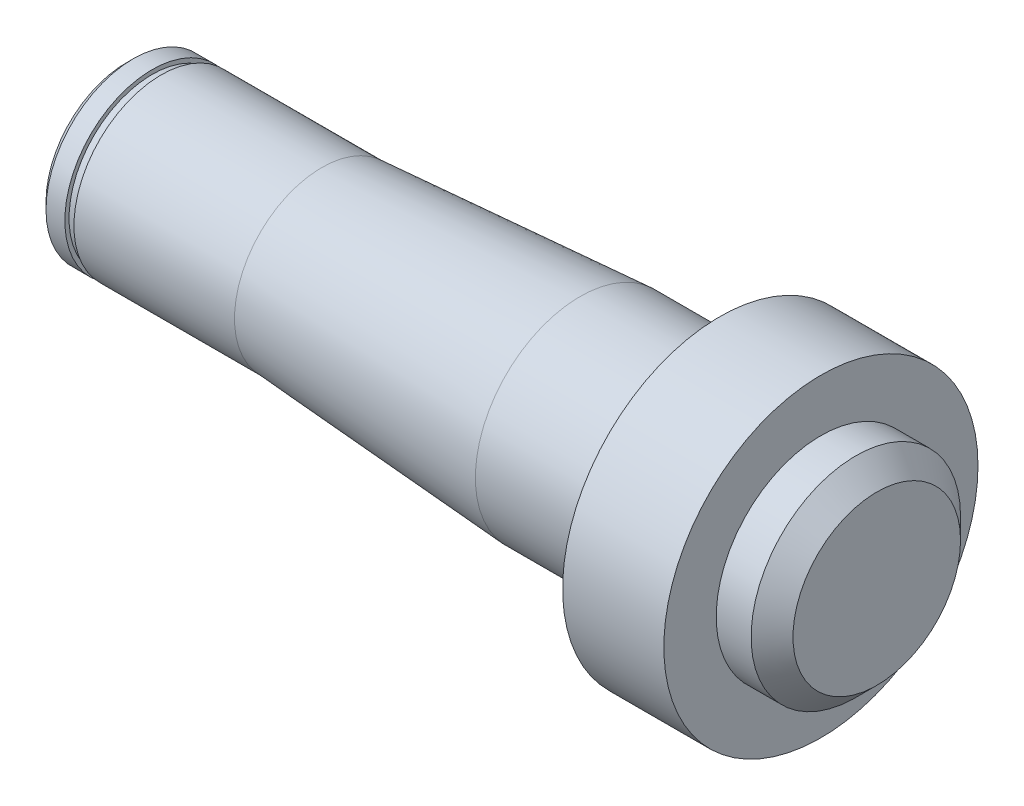
ISO-10303-21;
HEADER;
FILE_DESCRIPTION(('STEP AP214'),'2;1');
FILE_NAME('part.step','',(''),(''),'','','');
FILE_SCHEMA(('AUTOMOTIVE_DESIGN { 1 0 10303 214 1 1 1 1 }'));
ENDSEC;
DATA;
#1=APPLICATION_CONTEXT('core data for automotive mechanical design processes');
#2=APPLICATION_PROTOCOL_DEFINITION('international standard','automotive_design',2000,#1);
#3=PRODUCT_CONTEXT('',#1,'mechanical');
#4=PRODUCT('Part','Part','',(#3));
#5=PRODUCT_RELATED_PRODUCT_CATEGORY('part','',(#4));
#6=PRODUCT_DEFINITION_FORMATION('','',#4);
#7=PRODUCT_DEFINITION_CONTEXT('part definition',#1,'design');
#8=PRODUCT_DEFINITION('design','',#6,#7);
#9=PRODUCT_DEFINITION_SHAPE('','',#8);
#10=(LENGTH_UNIT() NAMED_UNIT(*) SI_UNIT(.MILLI.,.METRE.));
#11=(NAMED_UNIT(*) PLANE_ANGLE_UNIT() SI_UNIT($,.RADIAN.));
#12=(NAMED_UNIT(*) SI_UNIT($,.STERADIAN.) SOLID_ANGLE_UNIT());
#13=UNCERTAINTY_MEASURE_WITH_UNIT(LENGTH_MEASURE(1.E-05),#10,'distance_accuracy_value','');
#14=(GEOMETRIC_REPRESENTATION_CONTEXT(3) GLOBAL_UNCERTAINTY_ASSIGNED_CONTEXT((#13)) GLOBAL_UNIT_ASSIGNED_CONTEXT((#10,
#11,#12)) REPRESENTATION_CONTEXT('',''));
#15=CARTESIAN_POINT('',(0.,0.,0.));
#16=DIRECTION('',(0.,0.,1.));
#17=DIRECTION('',(1.,0.,0.));
#18=AXIS2_PLACEMENT_3D('',#15,#16,#17);
#19=CARTESIAN_POINT('',(0.,0.,0.));
#20=DIRECTION('',(1.,0.,0.));
#21=DIRECTION('',(0.,0.,-1.));
#22=AXIS2_PLACEMENT_3D('',#19,#20,#21);
#23=PLANE('',#22);
#24=CARTESIAN_POINT('',(0.,0.,0.));
#25=DIRECTION('',(1.,0.,0.));
#26=DIRECTION('',(0.,0.,-1.));
#27=AXIS2_PLACEMENT_3D('',#24,#25,#26);
#28=CIRCLE('',#27,12.);
#29=CARTESIAN_POINT('',(0.,0.,-12.));
#30=VERTEX_POINT('',#29);
#31=EDGE_CURVE('E51',#30,#30,#28,.T.);
#32=ORIENTED_EDGE('',*,*,#31,.T.);
#33=EDGE_LOOP('',(#32));
#34=FACE_BOUND('',#33,.T.);
#35=ADVANCED_FACE('F44',(#34),#23,.T.);
#36=CARTESIAN_POINT('',(0.,0.,0.));
#37=DIRECTION('',(1.,0.,0.));
#38=DIRECTION('',(0.,0.,-1.));
#39=AXIS2_PLACEMENT_3D('',#36,#37,#38);
#40=CYLINDRICAL_SURFACE('',#39,15.);
#41=CARTESIAN_POINT('',(-2.99999999999999,0.,0.));
#42=DIRECTION('',(1.,0.,0.));
#43=DIRECTION('',(0.,0.,-1.));
#44=AXIS2_PLACEMENT_3D('',#41,#42,#43);
#45=CIRCLE('',#44,15.);
#46=CARTESIAN_POINT('',(-2.99999999999999,0.,-15.));
#47=VERTEX_POINT('',#46);
#48=EDGE_CURVE('E12',#47,#47,#45,.F.);
#49=ORIENTED_EDGE('',*,*,#48,.T.);
#50=EDGE_LOOP('',(#49));
#51=FACE_BOUND('',#50,.T.);
#52=CARTESIAN_POINT('',(-8.,0.,0.));
#53=DIRECTION('',(1.,0.,0.));
#54=DIRECTION('',(0.,0.,-1.));
#55=AXIS2_PLACEMENT_3D('',#52,#53,#54);
#56=CIRCLE('',#55,15.);
#57=CARTESIAN_POINT('',(-8.,0.,-15.));
#58=VERTEX_POINT('',#57);
#59=EDGE_CURVE('E64',#58,#58,#56,.T.);
#60=ORIENTED_EDGE('',*,*,#59,.T.);
#61=EDGE_LOOP('',(#60));
#62=FACE_BOUND('',#61,.T.);
#63=ADVANCED_FACE('F113',(#51,#62),#40,.T.);
#64=CARTESIAN_POINT('',(-8.,15.,0.));
#65=DIRECTION('',(1.,0.,0.));
#66=DIRECTION('',(0.,0.,-1.));
#67=AXIS2_PLACEMENT_3D('',#64,#65,#66);
#68=PLANE('',#67);
#69=CARTESIAN_POINT('',(-8.,0.,0.));
#70=DIRECTION('',(1.,0.,0.));
#71=DIRECTION('',(0.,0.,-1.));
#72=AXIS2_PLACEMENT_3D('',#69,#70,#71);
#73=CIRCLE('',#72,22.5);
#74=CARTESIAN_POINT('',(-8.,0.,-22.5));
#75=VERTEX_POINT('',#74);
#76=EDGE_CURVE('E67',#75,#75,#73,.T.);
#77=ORIENTED_EDGE('',*,*,#76,.T.);
#78=EDGE_LOOP('',(#77));
#79=FACE_BOUND('',#78,.T.);
#80=ORIENTED_EDGE('',*,*,#59,.F.);
#81=EDGE_LOOP('',(#80));
#82=FACE_BOUND('',#81,.T.);
#83=ADVANCED_FACE('F118',(#79,#82),#68,.T.);
#84=CARTESIAN_POINT('',(0.,0.,0.));
#85=DIRECTION('',(1.,0.,0.));
#86=DIRECTION('',(0.,0.,-1.));
#87=AXIS2_PLACEMENT_3D('',#84,#85,#86);
#88=CYLINDRICAL_SURFACE('',#87,22.5);
#89=CARTESIAN_POINT('',(-22.5,0.,0.));
#90=DIRECTION('',(1.,0.,0.));
#91=DIRECTION('',(0.,0.,-1.));
#92=AXIS2_PLACEMENT_3D('',#89,#90,#91);
#93=CIRCLE('',#92,22.5);
#94=CARTESIAN_POINT('',(-22.5,0.,-22.5));
#95=VERTEX_POINT('',#94);
#96=EDGE_CURVE('E70',#95,#95,#93,.T.);
#97=ORIENTED_EDGE('',*,*,#96,.T.);
#98=EDGE_LOOP('',(#97));
#99=FACE_BOUND('',#98,.T.);
#100=ORIENTED_EDGE('',*,*,#76,.F.);
#101=EDGE_LOOP('',(#100));
#102=FACE_BOUND('',#101,.T.);
#103=ADVANCED_FACE('F224',(#99,#102),#88,.T.);
#104=CARTESIAN_POINT('',(-22.5,22.5,0.));
#105=DIRECTION('',(-1.,0.,0.));
#106=DIRECTION('',(0.,0.,1.));
#107=AXIS2_PLACEMENT_3D('',#104,#105,#106);
#108=PLANE('',#107);
#109=CARTESIAN_POINT('',(-22.5,0.,0.));
#110=DIRECTION('',(1.,0.,0.));
#111=DIRECTION('',(0.,0.,-1.));
#112=AXIS2_PLACEMENT_3D('',#109,#110,#111);
#113=CIRCLE('',#112,15.);
#114=CARTESIAN_POINT('',(-22.5,0.,-15.));
#115=VERTEX_POINT('',#114);
#116=EDGE_CURVE('E73',#115,#115,#113,.T.);
#117=ORIENTED_EDGE('',*,*,#116,.T.);
#118=EDGE_LOOP('',(#117));
#119=FACE_BOUND('',#118,.T.);
#120=ORIENTED_EDGE('',*,*,#96,.F.);
#121=EDGE_LOOP('',(#120));
#122=FACE_BOUND('',#121,.T.);
#123=ADVANCED_FACE('F214',(#119,#122),#108,.T.);
#124=CARTESIAN_POINT('',(0.,0.,0.));
#125=DIRECTION('',(1.,0.,0.));
#126=DIRECTION('',(0.,0.,-1.));
#127=AXIS2_PLACEMENT_3D('',#124,#125,#126);
#128=CYLINDRICAL_SURFACE('',#127,15.);
#129=CARTESIAN_POINT('',(-42.5,0.,0.));
#130=DIRECTION('',(1.,0.,0.));
#131=DIRECTION('',(0.,0.,-1.));
#132=AXIS2_PLACEMENT_3D('',#129,#130,#131);
#133=CIRCLE('',#132,15.);
#134=CARTESIAN_POINT('',(-42.5,0.,-15.));
#135=VERTEX_POINT('',#134);
#136=EDGE_CURVE('E76',#135,#135,#133,.T.);
#137=ORIENTED_EDGE('',*,*,#136,.T.);
#138=EDGE_LOOP('',(#137));
#139=FACE_BOUND('',#138,.T.);
#140=ORIENTED_EDGE('',*,*,#116,.F.);
#141=EDGE_LOOP('',(#140));
#142=FACE_BOUND('',#141,.T.);
#143=ADVANCED_FACE('F204',(#139,#142),#128,.T.);
#144=CARTESIAN_POINT('',(-42.5,0.,0.));
#145=DIRECTION('',(1.,0.,0.));
#146=DIRECTION('',(0.,0.,-1.));
#147=AXIS2_PLACEMENT_3D('',#144,#145,#146);
#148=CONICAL_SURFACE('',#147,15.,0.0674650245219049);
#149=CARTESIAN_POINT('',(-79.5,0.,0.));
#150=DIRECTION('',(1.,0.,0.));
#151=DIRECTION('',(0.,0.,-1.));
#152=AXIS2_PLACEMENT_3D('',#149,#150,#151);
#153=CIRCLE('',#152,12.5);
#154=CARTESIAN_POINT('',(-79.5,0.,-12.5));
#155=VERTEX_POINT('',#154);
#156=EDGE_CURVE('E79',#155,#155,#153,.T.);
#157=ORIENTED_EDGE('',*,*,#156,.T.);
#158=EDGE_LOOP('',(#157));
#159=FACE_BOUND('',#158,.T.);
#160=ORIENTED_EDGE('',*,*,#136,.F.);
#161=EDGE_LOOP('',(#160));
#162=FACE_BOUND('',#161,.T.);
#163=ADVANCED_FACE('F194',(#159,#162),#148,.T.);
#164=CARTESIAN_POINT('',(0.,0.,0.));
#165=DIRECTION('',(1.,0.,0.));
#166=DIRECTION('',(0.,0.,-1.));
#167=AXIS2_PLACEMENT_3D('',#164,#165,#166);
#168=CYLINDRICAL_SURFACE('',#167,12.5);
#169=CARTESIAN_POINT('',(-102.5,0.,0.));
#170=DIRECTION('',(1.,0.,0.));
#171=DIRECTION('',(0.,0.,-1.));
#172=AXIS2_PLACEMENT_3D('',#169,#170,#171);
#173=CIRCLE('',#172,12.5);
#174=CARTESIAN_POINT('',(-102.5,0.,-12.5));
#175=VERTEX_POINT('',#174);
#176=EDGE_CURVE('E82',#175,#175,#173,.T.);
#177=ORIENTED_EDGE('',*,*,#176,.T.);
#178=EDGE_LOOP('',(#177));
#179=FACE_BOUND('',#178,.T.);
#180=ORIENTED_EDGE('',*,*,#156,.F.);
#181=EDGE_LOOP('',(#180));
#182=FACE_BOUND('',#181,.T.);
#183=ADVANCED_FACE('F184',(#179,#182),#168,.T.);
#184=CARTESIAN_POINT('',(-102.5,12.5,0.));
#185=DIRECTION('',(-1.,0.,0.));
#186=DIRECTION('',(0.,0.,1.));
#187=AXIS2_PLACEMENT_3D('',#184,#185,#186);
#188=PLANE('',#187);
#189=CARTESIAN_POINT('',(-102.5,0.,0.));
#190=DIRECTION('',(1.,0.,0.));
#191=DIRECTION('',(0.,0.,-1.));
#192=AXIS2_PLACEMENT_3D('',#189,#190,#191);
#193=CIRCLE('',#192,11.9);
#194=CARTESIAN_POINT('',(-102.5,0.,-11.9));
#195=VERTEX_POINT('',#194);
#196=EDGE_CURVE('E85',#195,#195,#193,.T.);
#197=ORIENTED_EDGE('',*,*,#196,.T.);
#198=EDGE_LOOP('',(#197));
#199=FACE_BOUND('',#198,.T.);
#200=ORIENTED_EDGE('',*,*,#176,.F.);
#201=EDGE_LOOP('',(#200));
#202=FACE_BOUND('',#201,.T.);
#203=ADVANCED_FACE('F174',(#199,#202),#188,.T.);
#204=CARTESIAN_POINT('',(0.,0.,0.));
#205=DIRECTION('',(1.,0.,0.));
#206=DIRECTION('',(0.,0.,-1.));
#207=AXIS2_PLACEMENT_3D('',#204,#205,#206);
#208=CYLINDRICAL_SURFACE('',#207,11.9);
#209=CARTESIAN_POINT('',(-103.8,0.,0.));
#210=DIRECTION('',(1.,0.,0.));
#211=DIRECTION('',(0.,0.,-1.));
#212=AXIS2_PLACEMENT_3D('',#209,#210,#211);
#213=CIRCLE('',#212,11.9);
#214=CARTESIAN_POINT('',(-103.8,0.,-11.9));
#215=VERTEX_POINT('',#214);
#216=EDGE_CURVE('E88',#215,#215,#213,.T.);
#217=ORIENTED_EDGE('',*,*,#216,.T.);
#218=EDGE_LOOP('',(#217));
#219=FACE_BOUND('',#218,.T.);
#220=ORIENTED_EDGE('',*,*,#196,.F.);
#221=EDGE_LOOP('',(#220));
#222=FACE_BOUND('',#221,.T.);
#223=ADVANCED_FACE('F110',(#219,#222),#208,.T.);
#224=CARTESIAN_POINT('',(-103.8,11.9,0.));
#225=DIRECTION('',(1.,0.,0.));
#226=DIRECTION('',(0.,0.,-1.));
#227=AXIS2_PLACEMENT_3D('',#224,#225,#226);
#228=PLANE('',#227);
#229=CARTESIAN_POINT('',(-103.8,0.,0.));
#230=DIRECTION('',(1.,0.,0.));
#231=DIRECTION('',(0.,0.,-1.));
#232=AXIS2_PLACEMENT_3D('',#229,#230,#231);
#233=CIRCLE('',#232,12.5);
#234=CARTESIAN_POINT('',(-103.8,0.,-12.5));
#235=VERTEX_POINT('',#234);
#236=EDGE_CURVE('E91',#235,#235,#233,.T.);
#237=ORIENTED_EDGE('',*,*,#236,.T.);
#238=EDGE_LOOP('',(#237));
#239=FACE_BOUND('',#238,.T.);
#240=ORIENTED_EDGE('',*,*,#216,.F.);
#241=EDGE_LOOP('',(#240));
#242=FACE_BOUND('',#241,.T.);
#243=ADVANCED_FACE('F95',(#239,#242),#228,.T.);
#244=CARTESIAN_POINT('',(0.,0.,0.));
#245=DIRECTION('',(1.,0.,0.));
#246=DIRECTION('',(0.,0.,-1.));
#247=AXIS2_PLACEMENT_3D('',#244,#245,#246);
#248=CYLINDRICAL_SURFACE('',#247,12.5);
#249=CARTESIAN_POINT('',(-106.5,0.,0.));
#250=DIRECTION('',(-1.,0.,0.));
#251=DIRECTION('',(0.,0.,1.));
#252=AXIS2_PLACEMENT_3D('',#249,#250,#251);
#253=CIRCLE('',#252,12.5);
#254=CARTESIAN_POINT('',(-106.5,0.,12.5));
#255=VERTEX_POINT('',#254);
#256=EDGE_CURVE('E59',#255,#255,#253,.F.);
#257=ORIENTED_EDGE('',*,*,#256,.T.);
#258=EDGE_LOOP('',(#257));
#259=FACE_BOUND('',#258,.T.);
#260=ORIENTED_EDGE('',*,*,#236,.F.);
#261=EDGE_LOOP('',(#260));
#262=FACE_BOUND('',#261,.T.);
#263=ADVANCED_FACE('F98',(#259,#262),#248,.T.);
#264=CARTESIAN_POINT('',(-107.5,12.5,0.));
#265=DIRECTION('',(-1.,0.,0.));
#266=DIRECTION('',(0.,0.,1.));
#267=AXIS2_PLACEMENT_3D('',#264,#265,#266);
#268=PLANE('',#267);
#269=CARTESIAN_POINT('',(-107.5,0.,0.));
#270=DIRECTION('',(-1.,0.,0.));
#271=DIRECTION('',(0.,0.,1.));
#272=AXIS2_PLACEMENT_3D('',#269,#270,#271);
#273=CIRCLE('',#272,11.5);
#274=CARTESIAN_POINT('',(-107.5,0.,11.5));
#275=VERTEX_POINT('',#274);
#276=EDGE_CURVE('E55',#275,#275,#273,.T.);
#277=ORIENTED_EDGE('',*,*,#276,.T.);
#278=EDGE_LOOP('',(#277));
#279=FACE_BOUND('',#278,.T.);
#280=ADVANCED_FACE('F100',(#279),#268,.T.);
#281=CARTESIAN_POINT('',(-106.5,0.,0.));
#282=DIRECTION('',(1.,0.,0.));
#283=DIRECTION('',(0.,0.,-1.));
#284=AXIS2_PLACEMENT_3D('',#281,#282,#283);
#285=CONICAL_SURFACE('',#284,12.5,0.78539816339745);
#286=ORIENTED_EDGE('',*,*,#276,.F.);
#287=EDGE_LOOP('',(#286));
#288=FACE_BOUND('',#287,.T.);
#289=ORIENTED_EDGE('',*,*,#256,.F.);
#290=EDGE_LOOP('',(#289));
#291=FACE_BOUND('',#290,.T.);
#292=ADVANCED_FACE('F107',(#288,#291),#285,.T.);
#293=CARTESIAN_POINT('',(0.,0.,0.));
#294=DIRECTION('',(-1.,0.,0.));
#295=DIRECTION('',(0.,0.,1.));
#296=AXIS2_PLACEMENT_3D('',#293,#294,#295);
#297=CONICAL_SURFACE('',#296,12.,0.785398163397445);
#298=ORIENTED_EDGE('',*,*,#48,.F.);
#299=EDGE_LOOP('',(#298));
#300=FACE_BOUND('',#299,.T.);
#301=ORIENTED_EDGE('',*,*,#31,.F.);
#302=EDGE_LOOP('',(#301));
#303=FACE_BOUND('',#302,.T.);
#304=ADVANCED_FACE('F46',(#300,#303),#297,.T.);
#305=CLOSED_SHELL('',(#35,#63,#83,#103,#123,#143,#163,#183,#203,#223,#243,#263,#280,#292,#304));
#306=MANIFOLD_SOLID_BREP('B2',#305);
#307=ADVANCED_BREP_SHAPE_REPRESENTATION('',(#18,#306),#14);
#308=SHAPE_DEFINITION_REPRESENTATION(#9,#307);
ENDSEC;
END-ISO-10303-21;
